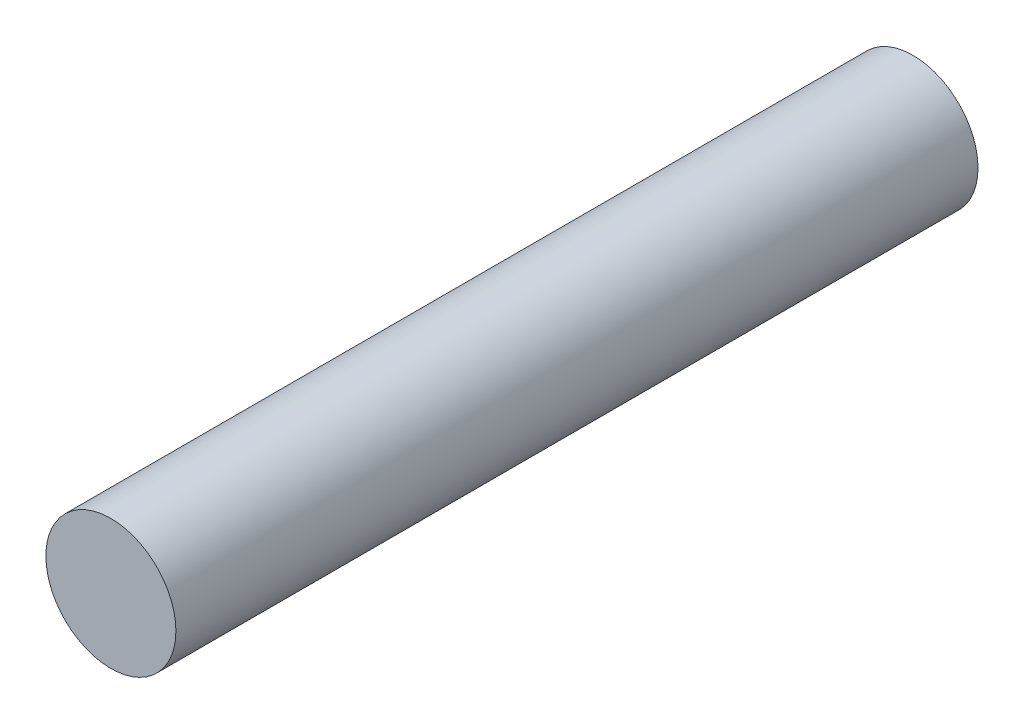
ISO-10303-21;
HEADER;
FILE_DESCRIPTION(('STEP AP214'),'2;1');
FILE_NAME('part.step','',(''),(''),'','','');
FILE_SCHEMA(('AUTOMOTIVE_DESIGN { 1 0 10303 214 1 1 1 1 }'));
ENDSEC;
DATA;
#1=APPLICATION_CONTEXT('core data for automotive mechanical design processes');
#2=APPLICATION_PROTOCOL_DEFINITION('international standard','automotive_design',2000,#1);
#3=PRODUCT_CONTEXT('',#1,'mechanical');
#4=PRODUCT('Part','Part','',(#3));
#5=PRODUCT_RELATED_PRODUCT_CATEGORY('part','',(#4));
#6=PRODUCT_DEFINITION_FORMATION('','',#4);
#7=PRODUCT_DEFINITION_CONTEXT('part definition',#1,'design');
#8=PRODUCT_DEFINITION('design','',#6,#7);
#9=PRODUCT_DEFINITION_SHAPE('','',#8);
#10=(LENGTH_UNIT() NAMED_UNIT(*) SI_UNIT(.MILLI.,.METRE.));
#11=(NAMED_UNIT(*) PLANE_ANGLE_UNIT() SI_UNIT($,.RADIAN.));
#12=(NAMED_UNIT(*) SI_UNIT($,.STERADIAN.) SOLID_ANGLE_UNIT());
#13=UNCERTAINTY_MEASURE_WITH_UNIT(LENGTH_MEASURE(1.E-05),#10,'distance_accuracy_value','');
#14=(GEOMETRIC_REPRESENTATION_CONTEXT(3) GLOBAL_UNCERTAINTY_ASSIGNED_CONTEXT((#13)) GLOBAL_UNIT_ASSIGNED_CONTEXT((#10,
#11,#12)) REPRESENTATION_CONTEXT('',''));
#15=CARTESIAN_POINT('',(0.,0.,0.));
#16=DIRECTION('',(0.,0.,1.));
#17=DIRECTION('',(1.,0.,0.));
#18=AXIS2_PLACEMENT_3D('',#15,#16,#17);
#19=CARTESIAN_POINT('',(0.,0.,8.02));
#20=DIRECTION('',(0.,0.,-1.));
#21=DIRECTION('',(-1.,0.,0.));
#22=AXIS2_PLACEMENT_3D('',#19,#20,#21);
#23=CYLINDRICAL_SURFACE('',#22,0.650000000000001);
#24=CARTESIAN_POINT('',(0.,0.,8.02));
#25=DIRECTION('',(0.,0.,1.));
#26=DIRECTION('',(1.,0.,0.));
#27=AXIS2_PLACEMENT_3D('',#24,#25,#26);
#28=CIRCLE('',#27,0.650000000000001);
#29=CARTESIAN_POINT('',(0.650000000000001,0.,8.02));
#30=VERTEX_POINT('',#29);
#31=EDGE_CURVE('E12',#30,#30,#28,.T.);
#32=ORIENTED_EDGE('',*,*,#31,.F.);
#33=EDGE_LOOP('',(#32));
#34=FACE_BOUND('',#33,.T.);
#35=CARTESIAN_POINT('',(0.,0.,0.));
#36=DIRECTION('',(0.,0.,1.));
#37=DIRECTION('',(1.,0.,0.));
#38=AXIS2_PLACEMENT_3D('',#35,#36,#37);
#39=CIRCLE('',#38,0.650000000000001);
#40=CARTESIAN_POINT('',(0.650000000000001,0.,0.));
#41=VERTEX_POINT('',#40);
#42=EDGE_CURVE('E45',#41,#41,#39,.T.);
#43=ORIENTED_EDGE('',*,*,#42,.T.);
#44=EDGE_LOOP('',(#43));
#45=FACE_BOUND('',#44,.T.);
#46=ADVANCED_FACE('F42',(#34,#45),#23,.T.);
#47=CARTESIAN_POINT('',(0.,0.,8.02));
#48=DIRECTION('',(0.,0.,1.));
#49=DIRECTION('',(1.,0.,0.));
#50=AXIS2_PLACEMENT_3D('',#47,#48,#49);
#51=PLANE('',#50);
#52=ORIENTED_EDGE('',*,*,#31,.T.);
#53=EDGE_LOOP('',(#52));
#54=FACE_BOUND('',#53,.T.);
#55=ADVANCED_FACE('F57',(#54),#51,.T.);
#56=CARTESIAN_POINT('',(0.,0.,0.));
#57=DIRECTION('',(0.,0.,1.));
#58=DIRECTION('',(1.,0.,0.));
#59=AXIS2_PLACEMENT_3D('',#56,#57,#58);
#60=PLANE('',#59);
#61=ORIENTED_EDGE('',*,*,#42,.F.);
#62=EDGE_LOOP('',(#61));
#63=FACE_BOUND('',#62,.T.);
#64=ADVANCED_FACE('F55',(#63),#60,.F.);
#65=CLOSED_SHELL('',(#46,#55,#64));
#66=MANIFOLD_SOLID_BREP('B2',#65);
#67=ADVANCED_BREP_SHAPE_REPRESENTATION('',(#18,#66),#14);
#68=SHAPE_DEFINITION_REPRESENTATION(#9,#67);
ENDSEC;
END-ISO-10303-21;
